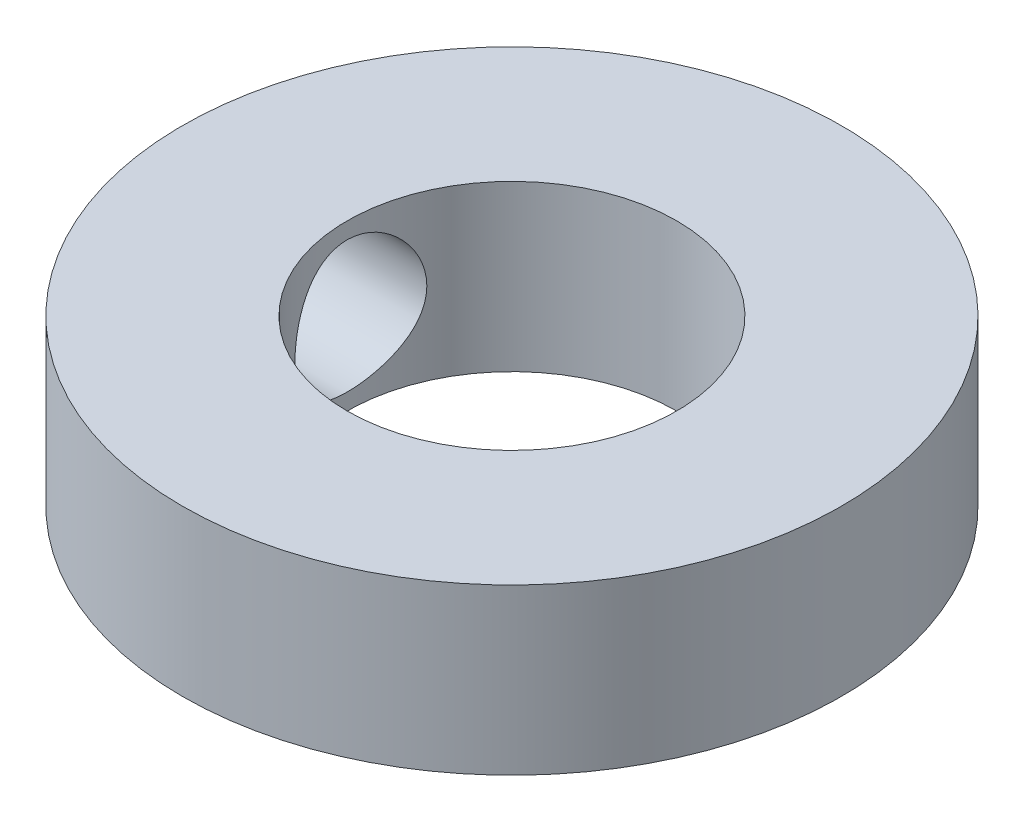
ISO-10303-21;
HEADER;
FILE_DESCRIPTION(('STEP AP214'),'2;1');
FILE_NAME('part.step','',(''),(''),'','','');
FILE_SCHEMA(('AUTOMOTIVE_DESIGN { 1 0 10303 214 1 1 1 1 }'));
ENDSEC;
DATA;
#1=APPLICATION_CONTEXT('core data for automotive mechanical design processes');
#2=APPLICATION_PROTOCOL_DEFINITION('international standard','automotive_design',2000,#1);
#3=PRODUCT_CONTEXT('',#1,'mechanical');
#4=PRODUCT('Part','Part','',(#3));
#5=PRODUCT_RELATED_PRODUCT_CATEGORY('part','',(#4));
#6=PRODUCT_DEFINITION_FORMATION('','',#4);
#7=PRODUCT_DEFINITION_CONTEXT('part definition',#1,'design');
#8=PRODUCT_DEFINITION('design','',#6,#7);
#9=PRODUCT_DEFINITION_SHAPE('','',#8);
#10=(LENGTH_UNIT() NAMED_UNIT(*) SI_UNIT(.MILLI.,.METRE.));
#11=(NAMED_UNIT(*) PLANE_ANGLE_UNIT() SI_UNIT($,.RADIAN.));
#12=(NAMED_UNIT(*) SI_UNIT($,.STERADIAN.) SOLID_ANGLE_UNIT());
#13=UNCERTAINTY_MEASURE_WITH_UNIT(LENGTH_MEASURE(1.E-05),#10,'distance_accuracy_value','');
#14=(GEOMETRIC_REPRESENTATION_CONTEXT(3) GLOBAL_UNCERTAINTY_ASSIGNED_CONTEXT((#13)) GLOBAL_UNIT_ASSIGNED_CONTEXT((#10,
#11,#12)) REPRESENTATION_CONTEXT('',''));
#15=CARTESIAN_POINT('',(0.,0.,0.));
#16=DIRECTION('',(0.,0.,1.));
#17=DIRECTION('',(1.,0.,0.));
#18=AXIS2_PLACEMENT_3D('',#15,#16,#17);
#19=CARTESIAN_POINT('',(0.,3.175,0.));
#20=DIRECTION('',(0.,1.,0.));
#21=DIRECTION('',(0.,0.,1.));
#22=AXIS2_PLACEMENT_3D('',#19,#20,#21);
#23=PLANE('',#22);
#24=CARTESIAN_POINT('',(0.,3.175,0.));
#25=DIRECTION('',(0.,1.,0.));
#26=DIRECTION('',(0.,0.,1.));
#27=AXIS2_PLACEMENT_3D('',#24,#25,#26);
#28=CIRCLE('',#27,6.35);
#29=CARTESIAN_POINT('',(0.,3.175,6.35));
#30=VERTEX_POINT('',#29);
#31=EDGE_CURVE('E10',#30,#30,#28,.T.);
#32=ORIENTED_EDGE('',*,*,#31,.T.);
#33=EDGE_LOOP('',(#32));
#34=FACE_BOUND('',#33,.T.);
#35=CARTESIAN_POINT('',(0.,3.175,0.));
#36=DIRECTION('',(0.,1.,0.));
#37=DIRECTION('',(0.,0.,1.));
#38=AXIS2_PLACEMENT_3D('',#35,#36,#37);
#39=CIRCLE('',#38,3.175);
#40=CARTESIAN_POINT('',(0.,3.175,3.175));
#41=VERTEX_POINT('',#40);
#42=EDGE_CURVE('E49',#41,#41,#39,.T.);
#43=ORIENTED_EDGE('',*,*,#42,.F.);
#44=EDGE_LOOP('',(#43));
#45=FACE_BOUND('',#44,.T.);
#46=ADVANCED_FACE('F31',(#34,#45),#23,.T.);
#47=CARTESIAN_POINT('',(0.,0.,0.));
#48=DIRECTION('',(0.,1.,0.));
#49=DIRECTION('',(0.,0.,1.));
#50=AXIS2_PLACEMENT_3D('',#47,#48,#49);
#51=PLANE('',#50);
#52=CARTESIAN_POINT('',(0.,0.,0.));
#53=DIRECTION('',(0.,1.,0.));
#54=DIRECTION('',(0.,0.,1.));
#55=AXIS2_PLACEMENT_3D('',#52,#53,#54);
#56=CIRCLE('',#55,6.35);
#57=CARTESIAN_POINT('',(0.,0.,6.35));
#58=VERTEX_POINT('',#57);
#59=EDGE_CURVE('E44',#58,#58,#56,.T.);
#60=ORIENTED_EDGE('',*,*,#59,.F.);
#61=EDGE_LOOP('',(#60));
#62=FACE_BOUND('',#61,.T.);
#63=CARTESIAN_POINT('',(0.,0.,0.));
#64=DIRECTION('',(0.,1.,0.));
#65=DIRECTION('',(0.,0.,1.));
#66=AXIS2_PLACEMENT_3D('',#63,#64,#65);
#67=CIRCLE('',#66,3.175);
#68=CARTESIAN_POINT('',(0.,0.,3.175));
#69=VERTEX_POINT('',#68);
#70=EDGE_CURVE('E51',#69,#69,#67,.T.);
#71=ORIENTED_EDGE('',*,*,#70,.T.);
#72=EDGE_LOOP('',(#71));
#73=FACE_BOUND('',#72,.T.);
#74=ADVANCED_FACE('F71',(#62,#73),#51,.F.);
#75=CARTESIAN_POINT('',(0.,3.175,0.));
#76=DIRECTION('',(0.,-1.,0.));
#77=DIRECTION('',(0.,0.,-1.));
#78=AXIS2_PLACEMENT_3D('',#75,#76,#77);
#79=CYLINDRICAL_SURFACE('',#78,6.35);
#80=CARTESIAN_POINT('',(-6.35,0.3175,0.));
#81=CARTESIAN_POINT('',(-6.34999869927706,0.317502596512898,-0.0705826716266442));
#82=CARTESIAN_POINT('',(-6.34881109176353,0.323404030568909,-0.141198168455933));
#83=CARTESIAN_POINT('',(-6.34418804341504,0.346835095146361,-0.280433154765054));
#84=CARTESIAN_POINT('',(-6.34075081682436,0.364373963657917,-0.349051013277522));
#85=CARTESIAN_POINT('',(-6.33201234583424,0.410516417498402,-0.482257487684407));
#86=CARTESIAN_POINT('',(-6.32671288727432,0.439109404792754,-0.54684989427508));
#87=CARTESIAN_POINT('',(-6.31482605504849,0.506516954339344,-0.670316145857566));
#88=CARTESIAN_POINT('',(-6.30823875809348,0.54533090782115,-0.729190331146281));
#89=CARTESIAN_POINT('',(-6.29440149969062,0.632635887750121,-0.840350716189878));
#90=CARTESIAN_POINT('',(-6.28714446790521,0.681238611346827,-0.892548317971326));
#91=CARTESIAN_POINT('',(-6.27283709174787,0.786501368817462,-0.988106680892196));
#92=CARTESIAN_POINT('',(-6.26578676355538,0.8431620313956,-1.03146675185844));
#93=CARTESIAN_POINT('',(-6.25262201102021,0.963569565125081,-1.10849632675148));
#94=CARTESIAN_POINT('',(-6.24651668353481,1.02737620762138,-1.14207409235965));
#95=CARTESIAN_POINT('',(-6.23603360434191,1.15986791013518,-1.19799819655699));
#96=CARTESIAN_POINT('',(-6.23165568197691,1.22855248744986,-1.22034564469529));
#97=CARTESIAN_POINT('',(-6.225194626703,1.36789714216305,-1.25288713085373));
#98=CARTESIAN_POINT('',(-6.22308217036128,1.43851953106063,-1.26323661240765));
#99=CARTESIAN_POINT('',(-6.22130296326997,1.58052747313271,-1.27197120221217));
#100=CARTESIAN_POINT('',(-6.22163596244158,1.65191294752658,-1.27035753384615));
#101=CARTESIAN_POINT('',(-6.22468339958194,1.79228342078667,-1.25533730783931));
#102=CARTESIAN_POINT('',(-6.2273618513063,1.86128838514669,-1.24210894610976));
#103=CARTESIAN_POINT('',(-6.23474173623201,1.99607941736201,-1.20451611347127));
#104=CARTESIAN_POINT('',(-6.23944326604379,2.06186533132714,-1.18015111073786));
#105=CARTESIAN_POINT('',(-6.25037635495518,2.18886438236357,-1.12080647526689));
#106=CARTESIAN_POINT('',(-6.25661804063405,2.25004360705285,-1.08575621206479));
#107=CARTESIAN_POINT('',(-6.26992165841789,2.36571897946547,-1.0060858397073));
#108=CARTESIAN_POINT('',(-6.27698368474725,2.42021435800097,-0.961464630733173));
#109=CARTESIAN_POINT('',(-6.29128816976657,2.52200334112031,-0.862964916891942));
#110=CARTESIAN_POINT('',(-6.29853158897849,2.5691497611811,-0.808934324739805));
#111=CARTESIAN_POINT('',(-6.31226637867299,2.65373338480255,-0.693654980558753));
#112=CARTESIAN_POINT('',(-6.31875773950996,2.69117046384285,-0.632406135971824));
#113=CARTESIAN_POINT('',(-6.33027296504327,2.75529993671699,-0.504265421336229));
#114=CARTESIAN_POINT('',(-6.33529452837305,2.78197550492856,-0.437364910873331));
#115=CARTESIAN_POINT('',(-6.3432868941458,2.82366780202898,-0.299909200089804));
#116=CARTESIAN_POINT('',(-6.34625794500675,2.83868594323351,-0.229354443592011));
#117=CARTESIAN_POINT('',(-6.34977993270922,2.85642869631873,-0.0878578451464813));
#118=CARTESIAN_POINT('',(-6.35037051808637,2.85935473281614,-0.0169422169734821));
#119=CARTESIAN_POINT('',(-6.3491751595123,2.85337267914343,0.124364666424747));
#120=CARTESIAN_POINT('',(-6.34738934915636,2.8444652542222,0.194755950903617));
#121=CARTESIAN_POINT('',(-6.34166666650182,2.81523646559918,0.332366188132107));
#122=CARTESIAN_POINT('',(-6.33774928033342,2.79501845300766,0.399607974391677));
#123=CARTESIAN_POINT('',(-6.32820111117511,2.74385534202712,0.529747006924577));
#124=CARTESIAN_POINT('',(-6.32257019982068,2.71290943996043,0.592643927279675));
#125=CARTESIAN_POINT('',(-6.31012087647284,2.64073323687283,0.713157290581497));
#126=CARTESIAN_POINT('',(-6.30328877055056,2.59938166808054,0.770699660975279));
#127=CARTESIAN_POINT('',(-6.28922713233951,2.50773032716675,0.878100884281393));
#128=CARTESIAN_POINT('',(-6.28199755749853,2.45742959567217,0.927958912342069));
#129=CARTESIAN_POINT('',(-6.26782215517346,2.34839084309827,1.0193535502832));
#130=CARTESIAN_POINT('',(-6.26088232496296,2.2895360048389,1.06075188210979));
#131=CARTESIAN_POINT('',(-6.24819923581167,2.16558957107702,1.13307548346503));
#132=CARTESIAN_POINT('',(-6.24245592899945,2.10049822524159,1.16400117202209));
#133=CARTESIAN_POINT('',(-6.23286460542166,1.96625432739007,1.21431283880909));
#134=CARTESIAN_POINT('',(-6.22900678087677,1.89712493166289,1.23375864473463));
#135=CARTESIAN_POINT('',(-6.22360244725872,1.75649451406655,1.26073998756654));
#136=CARTESIAN_POINT('',(-6.22205563677712,1.68499380271413,1.26827707764589));
#137=CARTESIAN_POINT('',(-6.22146520031851,1.54303874202872,1.27116955680168));
#138=CARTESIAN_POINT('',(-6.22237667370412,1.4725889408627,1.26674345085004));
#139=CARTESIAN_POINT('',(-6.22649978325459,1.33345980462062,1.24631742620708));
#140=CARTESIAN_POINT('',(-6.22971140094305,1.2647804553276,1.23031760048421));
#141=CARTESIAN_POINT('',(-6.23805285558331,1.13128080672451,1.18729578199367));
#142=CARTESIAN_POINT('',(-6.24317802693915,1.06645156216193,1.16030058353103));
#143=CARTESIAN_POINT('',(-6.25477178017196,0.94220827466726,1.09607939864404));
#144=CARTESIAN_POINT('',(-6.26124047468595,0.882794686369076,1.0588525543441));
#145=CARTESIAN_POINT('',(-6.27492979864496,0.769981223369101,0.974478511778746));
#146=CARTESIAN_POINT('',(-6.28216133595318,0.716700668110153,0.927173516788679));
#147=CARTESIAN_POINT('',(-6.29648323977382,0.618761518977953,0.824311748646688));
#148=CARTESIAN_POINT('',(-6.30357357346244,0.574104909297064,0.768753081684735));
#149=CARTESIAN_POINT('',(-6.31690167132724,0.494240002188012,0.650262388942073));
#150=CARTESIAN_POINT('',(-6.32312973648443,0.459135475834368,0.58725928322589));
#151=CARTESIAN_POINT('',(-6.3339360885795,0.400067624302328,0.45614127839473));
#152=CARTESIAN_POINT('',(-6.33851586166042,0.376094257293735,0.38803105129617));
#153=CARTESIAN_POINT('',(-6.34461993196121,0.344612025983211,0.2664732909332));
#154=CARTESIAN_POINT('',(-6.34662565011234,0.334463143991148,0.213717713297506));
#155=CARTESIAN_POINT('',(-6.34931615757664,0.320906251304877,0.107314397016785));
#156=CARTESIAN_POINT('',(-6.35000098898907,0.317498025772595,0.0536666868607461));
#157=CARTESIAN_POINT('',(-6.35,0.3175,0.));
#158=B_SPLINE_CURVE_WITH_KNOTS('',3,(#80,#81,#82,#83,#84,#85,#86,#87,#88,#89,#90,#91,#92,#93,
#94,#95,#96,#97,#98,#99,#100,#101,#102,#103,#104,#105,#106,#107,#108,#109,#110,#111,#112,#113,
#114,#115,#116,#117,#118,#119,#120,#121,#122,#123,#124,#125,#126,#127,#128,#129,#130,#131,#132,
#133,#134,#135,#136,#137,#138,#139,#140,#141,#142,#143,#144,#145,#146,#147,#148,#149,#150,#151,
#152,#153,#154,#155,#156,#157),.UNSPECIFIED.,.T.,.F.,(4,2,2,2,2,2,2,2,2,2,2,2,2,2,2,2,2,2,2,2,2,
2,2,2,2,2,2,2,2,2,2,2,2,2,2,2,2,2,4),(0.,0.211551685939798,0.42327150637798,0.634788843767934,
0.846293585833196,1.06036449104248,1.27445210786915,1.49048717657522,1.70650089693801,
1.91968355081556,2.13284440437156,2.34279093297973,2.55274748852237,2.76412312558563,
2.97552306532081,3.19072580664015,3.40593130775572,3.6214719906461,3.83698655636506,
4.04889634308857,4.26079421725492,4.47078676517419,4.68079504804348,4.89337433862366,
5.10597643199331,5.32181598295617,5.53764689678802,5.75234283911558,5.96701077779627,
6.17778447660981,6.38855648235613,6.5988179079145,6.8090969682897,7.02294856823712,
7.23684931256822,7.45298860778059,7.66893253507249,7.82978844618165,7.99063923041165),.UNSPECIFIED.);
#159=CARTESIAN_POINT('',(-6.35,0.3175,0.));
#160=VERTEX_POINT('',#159);
#161=EDGE_CURVE('E54',#160,#160,#158,.T.);
#162=ORIENTED_EDGE('',*,*,#161,.T.);
#163=EDGE_LOOP('',(#162));
#164=FACE_BOUND('',#163,.T.);
#165=ORIENTED_EDGE('',*,*,#31,.F.);
#166=EDGE_LOOP('',(#165));
#167=FACE_BOUND('',#166,.T.);
#168=ORIENTED_EDGE('',*,*,#59,.T.);
#169=EDGE_LOOP('',(#168));
#170=FACE_BOUND('',#169,.T.);
#171=ADVANCED_FACE('F33',(#164,#167,#170),#79,.T.);
#172=CARTESIAN_POINT('',(0.,3.175,0.));
#173=DIRECTION('',(0.,-1.,0.));
#174=DIRECTION('',(0.,0.,-1.));
#175=AXIS2_PLACEMENT_3D('',#172,#173,#174);
#176=CYLINDRICAL_SURFACE('',#175,3.175);
#177=CARTESIAN_POINT('',(-2.90993556629696,1.5875,-1.27));
#178=CARTESIAN_POINT('',(-2.90994243801828,1.65553358129343,-1.26999254141941));
#179=CARTESIAN_POINT('',(-2.91235512577508,1.72366338953749,-1.26450078480741));
#180=CARTESIAN_POINT('',(-2.92170430509282,1.85796861887694,-1.24273883442638));
#181=CARTESIAN_POINT('',(-2.92865235570651,1.92413859334611,-1.22644109832075));
#182=CARTESIAN_POINT('',(-2.94614889427473,2.05235361815098,-1.18378924568113));
#183=CARTESIAN_POINT('',(-2.95668380186768,2.11441318757376,-1.15747301685364));
#184=CARTESIAN_POINT('',(-2.98014812335503,2.23322200729586,-1.09564187105097));
#185=CARTESIAN_POINT('',(-2.99307701423991,2.2899724134108,-1.06012896258486));
#186=CARTESIAN_POINT('',(-3.02070049307406,2.39983035542332,-0.978739453863012));
#187=CARTESIAN_POINT('',(-3.03545187903804,2.45259632856021,-0.932420892156853));
#188=CARTESIAN_POINT('',(-3.06458910181545,2.54986091329526,-0.831665282166518));
#189=CARTESIAN_POINT('',(-3.07897480937596,2.59435663581906,-0.777225408764058));
#190=CARTESIAN_POINT('',(-3.10644164020853,2.67551306208402,-0.659134007076301));
#191=CARTESIAN_POINT('',(-3.11944895339066,2.71179563143386,-0.595203893163799));
#192=CARTESIAN_POINT('',(-3.14200494046032,2.77294566592753,-0.461534080025702));
#193=CARTESIAN_POINT('',(-3.15155502139268,2.79781777607154,-0.391796758497856));
#194=CARTESIAN_POINT('',(-3.16571836380261,2.83422184388775,-0.252073681042697));
#195=CARTESIAN_POINT('',(-3.17054824852352,2.84634134444653,-0.182263405350925));
#196=CARTESIAN_POINT('',(-3.17550997283516,2.85878808839581,-0.0414441186849091));
#197=CARTESIAN_POINT('',(-3.17564356468514,2.85911973001863,0.0295644352991302));
#198=CARTESIAN_POINT('',(-3.17132946391834,2.84830344119288,0.166517634144222));
#199=CARTESIAN_POINT('',(-3.16713867950116,2.8377992693057,0.232522682575011));
#200=CARTESIAN_POINT('',(-3.15499300082682,2.80670452354267,0.361742424353644));
#201=CARTESIAN_POINT('',(-3.14703783037906,2.78611320957575,0.42495691258775));
#202=CARTESIAN_POINT('',(-3.12798983530639,2.73517583337355,0.547940190954901));
#203=CARTESIAN_POINT('',(-3.11685152896418,2.70468743109214,0.607642690846067));
#204=CARTESIAN_POINT('',(-3.09254261589108,2.63495472060643,0.721238175720264));
#205=CARTESIAN_POINT('',(-3.07937131308322,2.59570741138301,0.775129160124729));
#206=CARTESIAN_POINT('',(-3.05131239608242,2.50656779867391,0.879328205775016));
#207=CARTESIAN_POINT('',(-3.03636887340352,2.45614577820927,0.929168731748762));
#208=CARTESIAN_POINT('',(-3.00711654712635,2.34760098689369,1.01987820876968));
#209=CARTESIAN_POINT('',(-2.9928079524998,2.28947570542211,1.06074422328738));
#210=CARTESIAN_POINT('',(-2.96606529875551,2.16508392077032,1.13341415985176));
#211=CARTESIAN_POINT('',(-2.95369560505177,2.09863383264278,1.16492950385166));
#212=CARTESIAN_POINT('',(-2.93298619946751,1.96074316355662,1.21613692507858));
#213=CARTESIAN_POINT('',(-2.92464387081321,1.88930585767051,1.23583668148679));
#214=CARTESIAN_POINT('',(-2.91356897392078,1.74813228132811,1.26171639250829));
#215=CARTESIAN_POINT('',(-2.91052482694528,1.6785587160787,1.26864878147334));
#216=CARTESIAN_POINT('',(-2.90950331151957,1.53919097306735,1.27099144229513));
#217=CARTESIAN_POINT('',(-2.91152440657164,1.46939686861857,1.26640520822648));
#218=CARTESIAN_POINT('',(-2.92008588166779,1.33574857630365,1.24652588819071));
#219=CARTESIAN_POINT('',(-2.92636230701584,1.27178248475132,1.23185749438489));
#220=CARTESIAN_POINT('',(-2.94239982402698,1.14726186296089,1.19304065868866));
#221=CARTESIAN_POINT('',(-2.95216168830352,1.08670809257686,1.16889011478202));
#222=CARTESIAN_POINT('',(-2.97455451481068,0.967992502799865,1.11070113107072));
#223=CARTESIAN_POINT('',(-2.98728577445851,0.910027270179021,1.07630142134802));
#224=CARTESIAN_POINT('',(-3.01402994575227,0.800428302974543,0.998959917520591));
#225=CARTESIAN_POINT('',(-3.02804337809,0.748797160774798,0.95601464466106));
#226=CARTESIAN_POINT('',(-3.05702281641837,0.649367885539501,0.859056074417107));
#227=CARTESIAN_POINT('',(-3.07198272626103,0.602134581040197,0.804459547697638));
#228=CARTESIAN_POINT('',(-3.10019569550402,0.517412556352435,0.687758107189217));
#229=CARTESIAN_POINT('',(-3.11344868541707,0.479924232810757,0.625652887927094));
#230=CARTESIAN_POINT('',(-3.13679659596681,0.415894757197122,0.495477758091119));
#231=CARTESIAN_POINT('',(-3.14689227262574,0.389350983954726,0.427409280431232));
#232=CARTESIAN_POINT('',(-3.16276173052999,0.348266478721155,0.287269930233708));
#233=CARTESIAN_POINT('',(-3.1685378571429,0.333719232585558,0.215201252536862));
#234=CARTESIAN_POINT('',(-3.17486670213675,0.317814514467881,0.0741784840699036));
#235=CARTESIAN_POINT('',(-3.17573562682994,0.315658418426217,0.00532796279659139));
#236=CARTESIAN_POINT('',(-3.17300636910406,0.322488229345407,-0.131720485690608));
#237=CARTESIAN_POINT('',(-3.16940886288989,0.331472449693869,-0.199918510115584));
#238=CARTESIAN_POINT('',(-3.15830910986302,0.359757210607634,-0.33157852273597));
#239=CARTESIAN_POINT('',(-3.150930202028,0.378732380757978,-0.395121640951724));
#240=CARTESIAN_POINT('',(-3.13305791873344,0.426118530896758,-0.518110695271926));
#241=CARTESIAN_POINT('',(-3.12256396888047,0.454531251222919,-0.57755587324972));
#242=CARTESIAN_POINT('',(-3.09891489918637,0.521400531040732,-0.693548931578633));
#243=CARTESIAN_POINT('',(-3.08566267377426,0.560245447252027,-0.74985269562208));
#244=CARTESIAN_POINT('',(-3.05809271023394,0.646295709678623,-0.855379308112786));
#245=CARTESIAN_POINT('',(-3.04377453252068,0.693504516252173,-0.904599210448555));
#246=CARTESIAN_POINT('',(-3.01458479860233,0.798395167573405,-0.997712803329604));
#247=CARTESIAN_POINT('',(-2.99973385704419,0.856544434609702,-1.04108814337138));
#248=CARTESIAN_POINT('',(-2.97211541386739,0.979768257267268,-1.11750313102902));
#249=CARTESIAN_POINT('',(-2.95934815728534,1.04484362589776,-1.15054156346649));
#250=CARTESIAN_POINT('',(-2.93851878930771,1.17413862317352,-1.20268434067255));
#251=CARTESIAN_POINT('',(-2.93013713318397,1.23791042406699,-1.22277347149427));
#252=CARTESIAN_POINT('',(-2.91748212288517,1.36809824146527,-1.25267577621467));
#253=CARTESIAN_POINT('',(-2.91319732365831,1.43450634863902,-1.26251758410889));
#254=CARTESIAN_POINT('',(-2.91036031311098,1.52995475208458,-1.26902480402696));
#255=CARTESIAN_POINT('',(-2.90993265925282,1.55871876533348,-1.27000315531175));
#256=CARTESIAN_POINT('',(-2.90993556629696,1.5875,-1.27));
#257=B_SPLINE_CURVE_WITH_KNOTS('',3,(#177,#178,#179,#180,#181,#182,#183,#184,#185,#186,#187,
#188,#189,#190,#191,#192,#193,#194,#195,#196,#197,#198,#199,#200,#201,#202,#203,#204,#205,#206,
#207,#208,#209,#210,#211,#212,#213,#214,#215,#216,#217,#218,#219,#220,#221,#222,#223,#224,#225,
#226,#227,#228,#229,#230,#231,#232,#233,#234,#235,#236,#237,#238,#239,#240,#241,#242,#243,#244,
#245,#246,#247,#248,#249,#250,#251,#252,#253,#254,#255,#256),.UNSPECIFIED.,.T.,.F.,(4,2,2,2,2,2,
2,2,2,2,2,2,2,2,2,2,2,2,2,2,2,2,2,2,2,2,2,2,2,2,2,2,2,2,2,2,2,2,2,4),(0.,0.20401130696746,
0.408544608247126,0.612311972791303,0.81603487303152,1.0303231761061,1.24468619711197,
1.46750194873057,1.6902269152562,1.90216906133362,2.11403212769102,2.31399489467242,
2.51397233506953,2.7169637064916,2.9200247348692,3.13641767991661,3.35288132525726,
3.57545931283756,3.79789248544261,4.00673663674203,4.21551744462738,4.41240702530263,
4.60934027739986,4.81425983200661,5.0192629772011,5.23940871243028,5.45956340677691,
5.67966534439832,5.89964768727073,6.10527760241226,6.31087638956698,6.51015966467725,
6.70947970917348,6.91760777470049,7.12582215014467,7.34692620832561,7.56805624913281,
7.76933079616309,7.97004140185416,8.05634727005666),.UNSPECIFIED.);
#258=CARTESIAN_POINT('',(-2.90993556629696,1.5875,-1.27));
#259=VERTEX_POINT('',#258);
#260=EDGE_CURVE('E36',#259,#259,#257,.T.);
#261=ORIENTED_EDGE('',*,*,#260,.F.);
#262=EDGE_LOOP('',(#261));
#263=FACE_BOUND('',#262,.T.);
#264=ORIENTED_EDGE('',*,*,#42,.T.);
#265=EDGE_LOOP('',(#264));
#266=FACE_BOUND('',#265,.T.);
#267=ORIENTED_EDGE('',*,*,#70,.F.);
#268=EDGE_LOOP('',(#267));
#269=FACE_BOUND('',#268,.T.);
#270=ADVANCED_FACE('F63',(#263,#266,#269),#176,.F.);
#271=CARTESIAN_POINT('',(-6.35,1.5875,0.));
#272=DIRECTION('',(1.,0.,0.));
#273=DIRECTION('',(0.,0.,-1.));
#274=AXIS2_PLACEMENT_3D('',#271,#272,#273);
#275=CYLINDRICAL_SURFACE('',#274,1.27);
#276=ORIENTED_EDGE('',*,*,#260,.T.);
#277=EDGE_LOOP('',(#276));
#278=FACE_BOUND('',#277,.T.);
#279=ORIENTED_EDGE('',*,*,#161,.F.);
#280=EDGE_LOOP('',(#279));
#281=FACE_BOUND('',#280,.T.);
#282=ADVANCED_FACE('F60',(#278,#281),#275,.F.);
#283=CLOSED_SHELL('',(#46,#74,#171,#270,#282));
#284=MANIFOLD_SOLID_BREP('B2',#283);
#285=ADVANCED_BREP_SHAPE_REPRESENTATION('',(#18,#284),#14);
#286=SHAPE_DEFINITION_REPRESENTATION(#9,#285);
ENDSEC;
END-ISO-10303-21;
